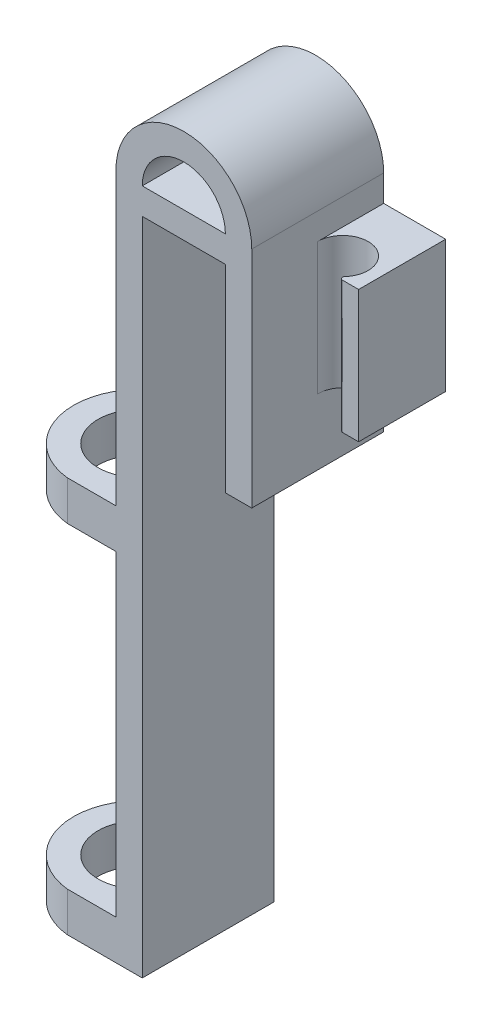
ISO-10303-21;
HEADER;
FILE_DESCRIPTION(('STEP AP214'),'2;1');
FILE_NAME('part.step','',(''),(''),'','','');
FILE_SCHEMA(('AUTOMOTIVE_DESIGN { 1 0 10303 214 1 1 1 1 }'));
ENDSEC;
DATA;
#1=APPLICATION_CONTEXT('core data for automotive mechanical design processes');
#2=APPLICATION_PROTOCOL_DEFINITION('international standard','automotive_design',2000,#1);
#3=PRODUCT_CONTEXT('',#1,'mechanical');
#4=PRODUCT('Part','Part','',(#3));
#5=PRODUCT_RELATED_PRODUCT_CATEGORY('part','',(#4));
#6=PRODUCT_DEFINITION_FORMATION('','',#4);
#7=PRODUCT_DEFINITION_CONTEXT('part definition',#1,'design');
#8=PRODUCT_DEFINITION('design','',#6,#7);
#9=PRODUCT_DEFINITION_SHAPE('','',#8);
#10=(LENGTH_UNIT() NAMED_UNIT(*) SI_UNIT(.MILLI.,.METRE.));
#11=(NAMED_UNIT(*) PLANE_ANGLE_UNIT() SI_UNIT($,.RADIAN.));
#12=(NAMED_UNIT(*) SI_UNIT($,.STERADIAN.) SOLID_ANGLE_UNIT());
#13=UNCERTAINTY_MEASURE_WITH_UNIT(LENGTH_MEASURE(1.E-05),#10,'distance_accuracy_value','');
#14=(GEOMETRIC_REPRESENTATION_CONTEXT(3) GLOBAL_UNCERTAINTY_ASSIGNED_CONTEXT((#13)) GLOBAL_UNIT_ASSIGNED_CONTEXT((#10,
#11,#12)) REPRESENTATION_CONTEXT('',''));
#15=CARTESIAN_POINT('',(0.,0.,0.));
#16=DIRECTION('',(0.,0.,1.));
#17=DIRECTION('',(1.,0.,0.));
#18=AXIS2_PLACEMENT_3D('',#15,#16,#17);
#19=CARTESIAN_POINT('',(0.,-50.,10.));
#20=DIRECTION('',(0.,-1.,0.));
#21=DIRECTION('',(0.,0.,-1.));
#22=AXIS2_PLACEMENT_3D('',#19,#20,#21);
#23=PLANE('',#22);
#24=CARTESIAN_POINT('',(-5.17499999999998,-50.,5.));
#25=DIRECTION('',(0.,-1.,0.));
#26=DIRECTION('',(0.,0.,-1.));
#27=AXIS2_PLACEMENT_3D('',#24,#25,#26);
#28=CIRCLE('',#27,3.175);
#29=CARTESIAN_POINT('',(-5.17499999999998,-50.,1.825));
#30=VERTEX_POINT('',#29);
#31=EDGE_CURVE('E316',#30,#30,#28,.F.);
#32=ORIENTED_EDGE('',*,*,#31,.T.);
#33=EDGE_LOOP('',(#32));
#34=FACE_BOUND('',#33,.T.);
#35=DIRECTION('',(-1.,0.,0.));
#36=VECTOR('',#35,1.);
#37=CARTESIAN_POINT('',(0.,-50.,10.));
#38=LINE('',#37,#36);
#39=CARTESIAN_POINT('',(0.,-50.,10.));
#40=VERTEX_POINT('',#39);
#41=CARTESIAN_POINT('',(-5.67562460986252,-50.,10.));
#42=VERTEX_POINT('',#41);
#43=EDGE_CURVE('E431',#40,#42,#38,.T.);
#44=ORIENTED_EDGE('',*,*,#43,.T.);
#45=CARTESIAN_POINT('',(-5.17499999999998,-50.,5.));
#46=DIRECTION('',(0.,-1.,0.));
#47=DIRECTION('',(0.,0.,-1.));
#48=AXIS2_PLACEMENT_3D('',#45,#46,#47);
#49=CIRCLE('',#48,5.025);
#50=CARTESIAN_POINT('',(-5.6756246098625,-50.,0.));
#51=VERTEX_POINT('',#50);
#52=EDGE_CURVE('E295',#51,#42,#49,.F.);
#53=ORIENTED_EDGE('',*,*,#52,.F.);
#54=DIRECTION('',(-1.,0.,0.));
#55=VECTOR('',#54,1.);
#56=CARTESIAN_POINT('',(0.,-50.,0.));
#57=LINE('',#56,#55);
#58=CARTESIAN_POINT('',(0.,-50.,0.));
#59=VERTEX_POINT('',#58);
#60=EDGE_CURVE('E362',#59,#51,#57,.T.);
#61=ORIENTED_EDGE('',*,*,#60,.F.);
#62=DIRECTION('',(0.,0.,-1.));
#63=VECTOR('',#62,1.);
#64=CARTESIAN_POINT('',(0.,-50.,10.));
#65=LINE('',#64,#63);
#66=EDGE_CURVE('E390',#40,#59,#65,.T.);
#67=ORIENTED_EDGE('',*,*,#66,.F.);
#68=EDGE_LOOP('',(#44,#53,#61,#67));
#69=FACE_BOUND('',#68,.T.);
#70=ADVANCED_FACE('F71',(#34,#69),#23,.T.);
#71=CARTESIAN_POINT('',(-1.99999999999999,-47.,-8.73155198117723));
#72=DIRECTION('',(0.,1.,0.));
#73=DIRECTION('',(0.,0.,1.));
#74=AXIS2_PLACEMENT_3D('',#71,#72,#73);
#75=PLANE('',#74);
#76=CARTESIAN_POINT('',(-5.17499999999998,-47.,5.));
#77=DIRECTION('',(0.,1.,0.));
#78=DIRECTION('',(0.,0.,1.));
#79=AXIS2_PLACEMENT_3D('',#76,#77,#78);
#80=CIRCLE('',#79,5.025);
#81=CARTESIAN_POINT('',(-5.67562460986251,-47.,0.));
#82=VERTEX_POINT('',#81);
#83=CARTESIAN_POINT('',(-5.67562460986253,-47.,10.));
#84=VERTEX_POINT('',#83);
#85=EDGE_CURVE('E310',#82,#84,#80,.T.);
#86=ORIENTED_EDGE('',*,*,#85,.T.);
#87=DIRECTION('',(-1.,0.,0.));
#88=VECTOR('',#87,1.);
#89=CARTESIAN_POINT('',(-1.99999999999999,-47.,10.));
#90=LINE('',#89,#88);
#91=CARTESIAN_POINT('',(-2.,-47.,10.));
#92=VERTEX_POINT('',#91);
#93=EDGE_CURVE('E350',#92,#84,#90,.T.);
#94=ORIENTED_EDGE('',*,*,#93,.F.);
#95=DIRECTION('',(0.,0.,1.));
#96=VECTOR('',#95,1.);
#97=CARTESIAN_POINT('',(-1.99999999999999,-47.,-8.73155198117723));
#98=LINE('',#97,#96);
#99=CARTESIAN_POINT('',(-1.99999999999999,-47.,5.));
#100=VERTEX_POINT('',#99);
#101=EDGE_CURVE('E354',#100,#92,#98,.T.);
#102=ORIENTED_EDGE('',*,*,#101,.F.);
#103=CARTESIAN_POINT('',(-5.17499999999998,-47.,5.));
#104=DIRECTION('',(0.,1.,0.));
#105=DIRECTION('',(0.,0.,1.));
#106=AXIS2_PLACEMENT_3D('',#103,#104,#105);
#107=CIRCLE('',#106,3.175);
#108=EDGE_CURVE('E323',#100,#100,#107,.T.);
#109=ORIENTED_EDGE('',*,*,#108,.F.);
#110=CARTESIAN_POINT('',(-1.99999999999999,-47.,0.));
#111=VERTEX_POINT('',#110);
#112=EDGE_CURVE('E355',#111,#100,#98,.T.);
#113=ORIENTED_EDGE('',*,*,#112,.F.);
#114=DIRECTION('',(1.,0.,0.));
#115=VECTOR('',#114,1.);
#116=CARTESIAN_POINT('',(-1.99999999999999,-47.,0.));
#117=LINE('',#116,#115);
#118=EDGE_CURVE('E359',#82,#111,#117,.T.);
#119=ORIENTED_EDGE('',*,*,#118,.F.);
#120=EDGE_LOOP('',(#86,#94,#102,#109,#113,#119));
#121=FACE_BOUND('',#120,.T.);
#122=ADVANCED_FACE('F513',(#121),#75,.T.);
#123=CARTESIAN_POINT('',(-1.99999999999999,-23.,-8.73155198117723));
#124=DIRECTION('',(0.,-1.,0.));
#125=DIRECTION('',(0.,0.,-1.));
#126=AXIS2_PLACEMENT_3D('',#123,#124,#125);
#127=PLANE('',#126);
#128=DIRECTION('',(1.,0.,0.));
#129=VECTOR('',#128,1.);
#130=CARTESIAN_POINT('',(-1.99999999999999,-23.,10.));
#131=LINE('',#130,#129);
#132=CARTESIAN_POINT('',(-5.67562460986254,-23.,10.));
#133=VERTEX_POINT('',#132);
#134=CARTESIAN_POINT('',(-1.99999999999999,-23.,10.));
#135=VERTEX_POINT('',#134);
#136=EDGE_CURVE('E336',#133,#135,#131,.T.);
#137=ORIENTED_EDGE('',*,*,#136,.F.);
#138=CARTESIAN_POINT('',(-5.17499999999999,-23.,5.));
#139=DIRECTION('',(0.,-1.,0.));
#140=DIRECTION('',(0.,0.,-1.));
#141=AXIS2_PLACEMENT_3D('',#138,#139,#140);
#142=CIRCLE('',#141,5.025);
#143=CARTESIAN_POINT('',(-5.67562460986252,-23.,0.));
#144=VERTEX_POINT('',#143);
#145=EDGE_CURVE('E299',#133,#144,#142,.T.);
#146=ORIENTED_EDGE('',*,*,#145,.T.);
#147=DIRECTION('',(-1.,0.,0.));
#148=VECTOR('',#147,1.);
#149=CARTESIAN_POINT('',(-1.99999999999999,-23.,0.));
#150=LINE('',#149,#148);
#151=CARTESIAN_POINT('',(-1.99999999999999,-23.,0.));
#152=VERTEX_POINT('',#151);
#153=EDGE_CURVE('E327',#152,#144,#150,.T.);
#154=ORIENTED_EDGE('',*,*,#153,.F.);
#155=DIRECTION('',(0.,0.,1.));
#156=VECTOR('',#155,1.);
#157=CARTESIAN_POINT('',(-1.99999999999999,-23.,-8.73155198117723));
#158=LINE('',#157,#156);
#159=CARTESIAN_POINT('',(-1.99999999999999,-23.,5.));
#160=VERTEX_POINT('',#159);
#161=EDGE_CURVE('E332',#152,#160,#158,.T.);
#162=ORIENTED_EDGE('',*,*,#161,.T.);
#163=CARTESIAN_POINT('',(-5.17499999999999,-23.,5.));
#164=DIRECTION('',(0.,-1.,0.));
#165=DIRECTION('',(0.,0.,-1.));
#166=AXIS2_PLACEMENT_3D('',#163,#164,#165);
#167=CIRCLE('',#166,3.175);
#168=EDGE_CURVE('E320',#160,#160,#167,.T.);
#169=ORIENTED_EDGE('',*,*,#168,.F.);
#170=EDGE_CURVE('E343',#160,#135,#158,.T.);
#171=ORIENTED_EDGE('',*,*,#170,.T.);
#172=EDGE_LOOP('',(#137,#146,#154,#162,#169,#171));
#173=FACE_BOUND('',#172,.T.);
#174=ADVANCED_FACE('F518',(#173),#127,.T.);
#175=CARTESIAN_POINT('',(-1.99999999999999,-20.,-8.73155198117723));
#176=DIRECTION('',(0.,1.,0.));
#177=DIRECTION('',(-1.,0.,0.));
#178=AXIS2_PLACEMENT_3D('',#175,#176,#177);
#179=PLANE('',#178);
#180=CARTESIAN_POINT('',(-5.17499999999999,-20.,5.));
#181=DIRECTION('',(0.,1.,0.));
#182=DIRECTION('',(-1.,0.,0.));
#183=AXIS2_PLACEMENT_3D('',#180,#181,#182);
#184=CIRCLE('',#183,5.025);
#185=CARTESIAN_POINT('',(-5.67562460986252,-20.,0.));
#186=VERTEX_POINT('',#185);
#187=CARTESIAN_POINT('',(-5.67562460986254,-20.,10.));
#188=VERTEX_POINT('',#187);
#189=EDGE_CURVE('E296',#186,#188,#184,.T.);
#190=ORIENTED_EDGE('',*,*,#189,.T.);
#191=DIRECTION('',(-1.,0.,0.));
#192=VECTOR('',#191,1.);
#193=CARTESIAN_POINT('',(-1.99999999999999,-20.,10.));
#194=LINE('',#193,#192);
#195=CARTESIAN_POINT('',(-1.99999999999999,-20.,10.));
#196=VERTEX_POINT('',#195);
#197=EDGE_CURVE('E326',#196,#188,#194,.T.);
#198=ORIENTED_EDGE('',*,*,#197,.F.);
#199=DIRECTION('',(0.,0.,1.));
#200=VECTOR('',#199,1.);
#201=CARTESIAN_POINT('',(-1.99999999999999,-20.,-8.73155198117723));
#202=LINE('',#201,#200);
#203=CARTESIAN_POINT('',(-1.99999999999999,-20.,5.));
#204=VERTEX_POINT('',#203);
#205=EDGE_CURVE('E339',#204,#196,#202,.T.);
#206=ORIENTED_EDGE('',*,*,#205,.F.);
#207=CARTESIAN_POINT('',(-5.17499999999999,-20.,5.));
#208=DIRECTION('',(0.,1.,0.));
#209=DIRECTION('',(-1.,0.,0.));
#210=AXIS2_PLACEMENT_3D('',#207,#208,#209);
#211=CIRCLE('',#210,3.175);
#212=EDGE_CURVE('E313',#204,#204,#211,.T.);
#213=ORIENTED_EDGE('',*,*,#212,.F.);
#214=CARTESIAN_POINT('',(-2.,-20.,0.));
#215=VERTEX_POINT('',#214);
#216=EDGE_CURVE('E344',#215,#204,#202,.T.);
#217=ORIENTED_EDGE('',*,*,#216,.F.);
#218=DIRECTION('',(1.,0.,0.));
#219=VECTOR('',#218,1.);
#220=CARTESIAN_POINT('',(-1.99999999999999,-20.,0.));
#221=LINE('',#220,#219);
#222=EDGE_CURVE('E331',#186,#215,#221,.T.);
#223=ORIENTED_EDGE('',*,*,#222,.F.);
#224=EDGE_LOOP('',(#190,#198,#206,#213,#217,#223));
#225=FACE_BOUND('',#224,.T.);
#226=ADVANCED_FACE('F556',(#225),#179,.T.);
#227=CARTESIAN_POINT('',(0.,0.,10.));
#228=DIRECTION('',(0.,0.,1.));
#229=DIRECTION('',(1.,0.,0.));
#230=AXIS2_PLACEMENT_3D('',#227,#228,#229);
#231=PLANE('',#230);
#232=DIRECTION('',(0.,1.,0.));
#233=VECTOR('',#232,1.);
#234=CARTESIAN_POINT('',(8.3,0.,10.));
#235=LINE('',#234,#233);
#236=CARTESIAN_POINT('',(8.3,-15.,10.));
#237=VERTEX_POINT('',#236);
#238=CARTESIAN_POINT('',(8.3,2.,10.));
#239=VERTEX_POINT('',#238);
#240=EDGE_CURVE('E373',#237,#239,#235,.T.);
#241=ORIENTED_EDGE('',*,*,#240,.T.);
#242=CARTESIAN_POINT('',(3.15,2.,10.));
#243=DIRECTION('',(0.,0.,1.));
#244=DIRECTION('',(1.,0.,0.));
#245=AXIS2_PLACEMENT_3D('',#242,#243,#244);
#246=CIRCLE('',#245,5.15);
#247=CARTESIAN_POINT('',(-2.,2.,10.));
#248=VERTEX_POINT('',#247);
#249=EDGE_CURVE('E266',#239,#248,#246,.T.);
#250=ORIENTED_EDGE('',*,*,#249,.T.);
#251=DIRECTION('',(0.,1.,0.));
#252=VECTOR('',#251,1.);
#253=CARTESIAN_POINT('',(-2.,0.,10.));
#254=LINE('',#253,#252);
#255=EDGE_CURVE('E380',#196,#248,#254,.T.);
#256=ORIENTED_EDGE('',*,*,#255,.F.);
#257=ORIENTED_EDGE('',*,*,#197,.T.);
#258=DIRECTION('',(0.,1.,0.));
#259=VECTOR('',#258,1.);
#260=CARTESIAN_POINT('',(-5.67562460986252,-56.7431426405558,10.));
#261=LINE('',#260,#259);
#262=EDGE_CURVE('E277',#133,#188,#261,.T.);
#263=ORIENTED_EDGE('',*,*,#262,.F.);
#264=ORIENTED_EDGE('',*,*,#136,.T.);
#265=EDGE_CURVE('E381',#92,#135,#254,.T.);
#266=ORIENTED_EDGE('',*,*,#265,.F.);
#267=ORIENTED_EDGE('',*,*,#93,.T.);
#268=EDGE_CURVE('E291',#42,#84,#261,.T.);
#269=ORIENTED_EDGE('',*,*,#268,.F.);
#270=ORIENTED_EDGE('',*,*,#43,.F.);
#271=DIRECTION('',(0.,-1.,0.));
#272=VECTOR('',#271,1.);
#273=CARTESIAN_POINT('',(0.,0.,10.));
#274=LINE('',#273,#272);
#275=CARTESIAN_POINT('',(0.,0.,10.));
#276=VERTEX_POINT('',#275);
#277=EDGE_CURVE('E435',#276,#40,#274,.T.);
#278=ORIENTED_EDGE('',*,*,#277,.F.);
#279=DIRECTION('',(1.,0.,0.));
#280=VECTOR('',#279,1.);
#281=CARTESIAN_POINT('',(0.,0.,10.));
#282=LINE('',#281,#280);
#283=CARTESIAN_POINT('',(6.3,0.,10.));
#284=VERTEX_POINT('',#283);
#285=EDGE_CURVE('E363',#276,#284,#282,.T.);
#286=ORIENTED_EDGE('',*,*,#285,.T.);
#287=DIRECTION('',(0.,-1.,0.));
#288=VECTOR('',#287,1.);
#289=CARTESIAN_POINT('',(6.3,0.,10.));
#290=LINE('',#289,#288);
#291=CARTESIAN_POINT('',(6.3,-15.,10.));
#292=VERTEX_POINT('',#291);
#293=EDGE_CURVE('E366',#284,#292,#290,.T.);
#294=ORIENTED_EDGE('',*,*,#293,.T.);
#295=DIRECTION('',(1.,0.,0.));
#296=VECTOR('',#295,1.);
#297=CARTESIAN_POINT('',(0.,-15.,10.));
#298=LINE('',#297,#296);
#299=EDGE_CURVE('E370',#292,#237,#298,.T.);
#300=ORIENTED_EDGE('',*,*,#299,.T.);
#301=EDGE_LOOP('',(#241,#250,#256,#257,#263,#264,#266,#267,#269,#270,#278,#286,#294,#300));
#302=FACE_BOUND('',#301,.T.);
#303=DIRECTION('',(1.,0.,0.));
#304=VECTOR('',#303,1.);
#305=CARTESIAN_POINT('',(0.,2.,10.));
#306=LINE('',#305,#304);
#307=CARTESIAN_POINT('',(0.,2.,10.));
#308=VERTEX_POINT('',#307);
#309=CARTESIAN_POINT('',(6.3,2.,10.));
#310=VERTEX_POINT('',#309);
#311=EDGE_CURVE('E376',#308,#310,#306,.T.);
#312=ORIENTED_EDGE('',*,*,#311,.F.);
#313=CARTESIAN_POINT('',(3.15,2.,10.));
#314=DIRECTION('',(0.,0.,-1.));
#315=DIRECTION('',(1.,0.,0.));
#316=AXIS2_PLACEMENT_3D('',#313,#314,#315);
#317=CIRCLE('',#316,3.15);
#318=EDGE_CURVE('E281',#308,#310,#317,.T.);
#319=ORIENTED_EDGE('',*,*,#318,.T.);
#320=EDGE_LOOP('',(#312,#319));
#321=FACE_BOUND('',#320,.T.);
#322=ADVANCED_FACE('F553',(#302,#321),#231,.T.);
#323=CARTESIAN_POINT('',(0.,0.,0.));
#324=DIRECTION('',(0.,0.,1.));
#325=DIRECTION('',(1.,0.,0.));
#326=AXIS2_PLACEMENT_3D('',#323,#324,#325);
#327=PLANE('',#326);
#328=CARTESIAN_POINT('',(3.15,2.,0.));
#329=DIRECTION('',(0.,0.,1.));
#330=DIRECTION('',(1.,0.,0.));
#331=AXIS2_PLACEMENT_3D('',#328,#329,#330);
#332=CIRCLE('',#331,3.15);
#333=CARTESIAN_POINT('',(6.3,2.,0.));
#334=VERTEX_POINT('',#333);
#335=CARTESIAN_POINT('',(0.,2.,0.));
#336=VERTEX_POINT('',#335);
#337=EDGE_CURVE('E268',#334,#336,#332,.T.);
#338=ORIENTED_EDGE('',*,*,#337,.T.);
#339=DIRECTION('',(1.,0.,0.));
#340=VECTOR('',#339,1.);
#341=CARTESIAN_POINT('',(0.,2.,0.));
#342=LINE('',#341,#340);
#343=EDGE_CURVE('E400',#336,#334,#342,.T.);
#344=ORIENTED_EDGE('',*,*,#343,.T.);
#345=EDGE_LOOP('',(#338,#344));
#346=FACE_BOUND('',#345,.T.);
#347=DIRECTION('',(0.,1.,0.));
#348=VECTOR('',#347,1.);
#349=CARTESIAN_POINT('',(-5.6756246098625,-56.7431426405558,0.));
#350=LINE('',#349,#348);
#351=EDGE_CURVE('E303',#144,#186,#350,.T.);
#352=ORIENTED_EDGE('',*,*,#351,.T.);
#353=ORIENTED_EDGE('',*,*,#222,.T.);
#354=DIRECTION('',(0.,1.,0.));
#355=VECTOR('',#354,1.);
#356=CARTESIAN_POINT('',(-2.,0.,0.));
#357=LINE('',#356,#355);
#358=CARTESIAN_POINT('',(-2.,2.,0.));
#359=VERTEX_POINT('',#358);
#360=EDGE_CURVE('E404',#215,#359,#357,.T.);
#361=ORIENTED_EDGE('',*,*,#360,.T.);
#362=CARTESIAN_POINT('',(3.15,2.,0.));
#363=DIRECTION('',(0.,0.,1.));
#364=DIRECTION('',(1.,0.,0.));
#365=AXIS2_PLACEMENT_3D('',#362,#363,#364);
#366=CIRCLE('',#365,5.15);
#367=CARTESIAN_POINT('',(8.3,2.,0.));
#368=VERTEX_POINT('',#367);
#369=EDGE_CURVE('E272',#359,#368,#366,.F.);
#370=ORIENTED_EDGE('',*,*,#369,.T.);
#371=DIRECTION('',(0.,1.,0.));
#372=VECTOR('',#371,1.);
#373=CARTESIAN_POINT('',(8.3,0.,0.));
#374=LINE('',#373,#372);
#375=CARTESIAN_POINT('',(8.3,0.,0.));
#376=VERTEX_POINT('',#375);
#377=EDGE_CURVE('E396',#376,#368,#374,.T.);
#378=ORIENTED_EDGE('',*,*,#377,.F.);
#379=DIRECTION('',(1.,0.,0.));
#380=VECTOR('',#379,1.);
#381=CARTESIAN_POINT('',(8.3,0.,0.));
#382=LINE('',#381,#380);
#383=CARTESIAN_POINT('',(13.,0.,0.));
#384=VERTEX_POINT('',#383);
#385=EDGE_CURVE('E267',#376,#384,#382,.T.);
#386=ORIENTED_EDGE('',*,*,#385,.T.);
#387=DIRECTION('',(0.,-1.,0.));
#388=VECTOR('',#387,1.);
#389=CARTESIAN_POINT('',(13.,0.,0.));
#390=LINE('',#389,#388);
#391=CARTESIAN_POINT('',(13.,-10.,0.));
#392=VERTEX_POINT('',#391);
#393=EDGE_CURVE('E468',#384,#392,#390,.T.);
#394=ORIENTED_EDGE('',*,*,#393,.T.);
#395=DIRECTION('',(-1.,0.,0.));
#396=VECTOR('',#395,1.);
#397=CARTESIAN_POINT('',(8.3,-10.,0.));
#398=LINE('',#397,#396);
#399=CARTESIAN_POINT('',(8.3,-10.,0.));
#400=VERTEX_POINT('',#399);
#401=EDGE_CURVE('E251',#392,#400,#398,.T.);
#402=ORIENTED_EDGE('',*,*,#401,.T.);
#403=CARTESIAN_POINT('',(8.3,-15.,0.));
#404=VERTEX_POINT('',#403);
#405=EDGE_CURVE('E397',#404,#400,#374,.T.);
#406=ORIENTED_EDGE('',*,*,#405,.F.);
#407=DIRECTION('',(1.,0.,0.));
#408=VECTOR('',#407,1.);
#409=CARTESIAN_POINT('',(0.,-15.,0.));
#410=LINE('',#409,#408);
#411=CARTESIAN_POINT('',(6.3,-15.,0.));
#412=VERTEX_POINT('',#411);
#413=EDGE_CURVE('E393',#412,#404,#410,.T.);
#414=ORIENTED_EDGE('',*,*,#413,.F.);
#415=DIRECTION('',(0.,-1.,0.));
#416=VECTOR('',#415,1.);
#417=CARTESIAN_POINT('',(6.3,0.,0.));
#418=LINE('',#417,#416);
#419=CARTESIAN_POINT('',(6.3,0.,0.));
#420=VERTEX_POINT('',#419);
#421=EDGE_CURVE('E389',#420,#412,#418,.T.);
#422=ORIENTED_EDGE('',*,*,#421,.F.);
#423=DIRECTION('',(1.,0.,0.));
#424=VECTOR('',#423,1.);
#425=CARTESIAN_POINT('',(0.,0.,0.));
#426=LINE('',#425,#424);
#427=CARTESIAN_POINT('',(0.,0.,0.));
#428=VERTEX_POINT('',#427);
#429=EDGE_CURVE('E386',#428,#420,#426,.T.);
#430=ORIENTED_EDGE('',*,*,#429,.F.);
#431=DIRECTION('',(0.,-1.,0.));
#432=VECTOR('',#431,1.);
#433=CARTESIAN_POINT('',(0.,0.,0.));
#434=LINE('',#433,#432);
#435=EDGE_CURVE('E436',#428,#59,#434,.T.);
#436=ORIENTED_EDGE('',*,*,#435,.T.);
#437=ORIENTED_EDGE('',*,*,#60,.T.);
#438=EDGE_CURVE('E300',#51,#82,#350,.T.);
#439=ORIENTED_EDGE('',*,*,#438,.T.);
#440=ORIENTED_EDGE('',*,*,#118,.T.);
#441=EDGE_CURVE('E367',#111,#152,#357,.T.);
#442=ORIENTED_EDGE('',*,*,#441,.T.);
#443=ORIENTED_EDGE('',*,*,#153,.T.);
#444=EDGE_LOOP('',(#352,#353,#361,#370,#378,#386,#394,#402,#406,#414,#422,#430,#436,#437,#439,
#440,#442,#443));
#445=FACE_BOUND('',#444,.T.);
#446=ADVANCED_FACE('F498',(#346,#445),#327,.F.);
#447=CARTESIAN_POINT('',(-2.,0.,10.));
#448=DIRECTION('',(-1.,0.,0.));
#449=DIRECTION('',(0.,0.,1.));
#450=AXIS2_PLACEMENT_3D('',#447,#448,#449);
#451=PLANE('',#450);
#452=ORIENTED_EDGE('',*,*,#170,.F.);
#453=ORIENTED_EDGE('',*,*,#161,.F.);
#454=ORIENTED_EDGE('',*,*,#441,.F.);
#455=ORIENTED_EDGE('',*,*,#112,.T.);
#456=ORIENTED_EDGE('',*,*,#101,.T.);
#457=ORIENTED_EDGE('',*,*,#265,.T.);
#458=EDGE_LOOP('',(#452,#453,#454,#455,#456,#457));
#459=FACE_BOUND('',#458,.T.);
#460=ADVANCED_FACE('F549',(#459),#451,.T.);
#461=ORIENTED_EDGE('',*,*,#216,.T.);
#462=ORIENTED_EDGE('',*,*,#205,.T.);
#463=ORIENTED_EDGE('',*,*,#255,.T.);
#464=DIRECTION('',(0.,0.,-1.));
#465=VECTOR('',#464,1.);
#466=CARTESIAN_POINT('',(-2.,2.,10.));
#467=LINE('',#466,#465);
#468=EDGE_CURVE('E385',#248,#359,#467,.T.);
#469=ORIENTED_EDGE('',*,*,#468,.T.);
#470=ORIENTED_EDGE('',*,*,#360,.F.);
#471=EDGE_LOOP('',(#461,#462,#463,#469,#470));
#472=FACE_BOUND('',#471,.T.);
#473=ADVANCED_FACE('F530',(#472),#451,.T.);
#474=CARTESIAN_POINT('',(0.,0.,10.));
#475=DIRECTION('',(0.,1.,0.));
#476=DIRECTION('',(0.,0.,1.));
#477=AXIS2_PLACEMENT_3D('',#474,#475,#476);
#478=PLANE('',#477);
#479=ORIENTED_EDGE('',*,*,#285,.F.);
#480=DIRECTION('',(0.,0.,-1.));
#481=VECTOR('',#480,1.);
#482=CARTESIAN_POINT('',(0.,0.,10.));
#483=LINE('',#482,#481);
#484=EDGE_CURVE('E427',#276,#428,#483,.T.);
#485=ORIENTED_EDGE('',*,*,#484,.T.);
#486=ORIENTED_EDGE('',*,*,#429,.T.);
#487=DIRECTION('',(0.,0.,-1.));
#488=VECTOR('',#487,1.);
#489=CARTESIAN_POINT('',(6.3,0.,10.));
#490=LINE('',#489,#488);
#491=EDGE_CURVE('E423',#284,#420,#490,.T.);
#492=ORIENTED_EDGE('',*,*,#491,.F.);
#493=EDGE_LOOP('',(#479,#485,#486,#492));
#494=FACE_BOUND('',#493,.T.);
#495=ADVANCED_FACE('F529',(#494),#478,.F.);
#496=CARTESIAN_POINT('',(6.3,0.,10.));
#497=DIRECTION('',(1.,0.,0.));
#498=DIRECTION('',(0.,1.,0.));
#499=AXIS2_PLACEMENT_3D('',#496,#497,#498);
#500=PLANE('',#499);
#501=ORIENTED_EDGE('',*,*,#421,.T.);
#502=DIRECTION('',(0.,0.,-1.));
#503=VECTOR('',#502,1.);
#504=CARTESIAN_POINT('',(6.3,-15.,10.));
#505=LINE('',#504,#503);
#506=EDGE_CURVE('E419',#292,#412,#505,.T.);
#507=ORIENTED_EDGE('',*,*,#506,.F.);
#508=ORIENTED_EDGE('',*,*,#293,.F.);
#509=ORIENTED_EDGE('',*,*,#491,.T.);
#510=EDGE_LOOP('',(#501,#507,#508,#509));
#511=FACE_BOUND('',#510,.T.);
#512=ADVANCED_FACE('F533',(#511),#500,.F.);
#513=CARTESIAN_POINT('',(0.,-15.,10.));
#514=DIRECTION('',(0.,1.,0.));
#515=DIRECTION('',(-1.,0.,0.));
#516=AXIS2_PLACEMENT_3D('',#513,#514,#515);
#517=PLANE('',#516);
#518=ORIENTED_EDGE('',*,*,#413,.T.);
#519=DIRECTION('',(0.,0.,-1.));
#520=VECTOR('',#519,1.);
#521=CARTESIAN_POINT('',(8.3,-15.,10.));
#522=LINE('',#521,#520);
#523=EDGE_CURVE('E415',#237,#404,#522,.T.);
#524=ORIENTED_EDGE('',*,*,#523,.F.);
#525=ORIENTED_EDGE('',*,*,#299,.F.);
#526=ORIENTED_EDGE('',*,*,#506,.T.);
#527=EDGE_LOOP('',(#518,#524,#525,#526));
#528=FACE_BOUND('',#527,.T.);
#529=ADVANCED_FACE('F537',(#528),#517,.F.);
#530=CARTESIAN_POINT('',(8.3,0.,10.));
#531=DIRECTION('',(-1.,0.,0.));
#532=DIRECTION('',(0.,0.,1.));
#533=AXIS2_PLACEMENT_3D('',#530,#531,#532);
#534=PLANE('',#533);
#535=ORIENTED_EDGE('',*,*,#405,.T.);
#536=DIRECTION('',(0.,0.,1.));
#537=VECTOR('',#536,1.);
#538=CARTESIAN_POINT('',(8.3,-10.,-11.0494343746637));
#539=LINE('',#538,#537);
#540=CARTESIAN_POINT('',(8.3,-10.,5.));
#541=VERTEX_POINT('',#540);
#542=EDGE_CURVE('E253',#400,#541,#539,.T.);
#543=ORIENTED_EDGE('',*,*,#542,.T.);
#544=DIRECTION('',(0.,1.,0.));
#545=VECTOR('',#544,1.);
#546=CARTESIAN_POINT('',(8.3,-16.8622153857191,5.));
#547=LINE('',#546,#545);
#548=CARTESIAN_POINT('',(8.3,0.,5.));
#549=VERTEX_POINT('',#548);
#550=EDGE_CURVE('E234',#541,#549,#547,.T.);
#551=ORIENTED_EDGE('',*,*,#550,.T.);
#552=DIRECTION('',(0.,0.,1.));
#553=VECTOR('',#552,1.);
#554=CARTESIAN_POINT('',(8.3,0.,-11.0494343746637));
#555=LINE('',#554,#553);
#556=EDGE_CURVE('E257',#376,#549,#555,.T.);
#557=ORIENTED_EDGE('',*,*,#556,.F.);
#558=ORIENTED_EDGE('',*,*,#377,.T.);
#559=DIRECTION('',(0.,0.,-1.));
#560=VECTOR('',#559,1.);
#561=CARTESIAN_POINT('',(8.3,2.,10.));
#562=LINE('',#561,#560);
#563=EDGE_CURVE('E411',#239,#368,#562,.T.);
#564=ORIENTED_EDGE('',*,*,#563,.F.);
#565=ORIENTED_EDGE('',*,*,#240,.F.);
#566=ORIENTED_EDGE('',*,*,#523,.T.);
#567=EDGE_LOOP('',(#535,#543,#551,#557,#558,#564,#565,#566));
#568=FACE_BOUND('',#567,.T.);
#569=ADVANCED_FACE('F492',(#568),#534,.F.);
#570=CARTESIAN_POINT('',(0.,2.,10.));
#571=DIRECTION('',(0.,1.,0.));
#572=DIRECTION('',(0.,0.,1.));
#573=AXIS2_PLACEMENT_3D('',#570,#571,#572);
#574=PLANE('',#573);
#575=DIRECTION('',(0.,0.,1.));
#576=VECTOR('',#575,1.);
#577=CARTESIAN_POINT('',(0.,2.,-11.5157500841239));
#578=LINE('',#577,#576);
#579=EDGE_CURVE('E285',#336,#308,#578,.T.);
#580=ORIENTED_EDGE('',*,*,#579,.T.);
#581=ORIENTED_EDGE('',*,*,#311,.T.);
#582=DIRECTION('',(0.,0.,1.));
#583=VECTOR('',#582,1.);
#584=CARTESIAN_POINT('',(6.3,2.,-11.5157500841239));
#585=LINE('',#584,#583);
#586=EDGE_CURVE('E273',#334,#310,#585,.T.);
#587=ORIENTED_EDGE('',*,*,#586,.F.);
#588=ORIENTED_EDGE('',*,*,#343,.F.);
#589=EDGE_LOOP('',(#580,#581,#587,#588));
#590=FACE_BOUND('',#589,.T.);
#591=ADVANCED_FACE('F527',(#590),#574,.T.);
#592=CARTESIAN_POINT('',(0.,0.,10.));
#593=DIRECTION('',(1.,0.,0.));
#594=DIRECTION('',(0.,1.,0.));
#595=AXIS2_PLACEMENT_3D('',#592,#593,#594);
#596=PLANE('',#595);
#597=ORIENTED_EDGE('',*,*,#435,.F.);
#598=ORIENTED_EDGE('',*,*,#484,.F.);
#599=ORIENTED_EDGE('',*,*,#277,.T.);
#600=ORIENTED_EDGE('',*,*,#66,.T.);
#601=EDGE_LOOP('',(#597,#598,#599,#600));
#602=FACE_BOUND('',#601,.T.);
#603=ADVANCED_FACE('F523',(#602),#596,.T.);
#604=CARTESIAN_POINT('',(-5.17499999999997,-58.9802561210692,5.));
#605=DIRECTION('',(0.,1.,0.));
#606=DIRECTION('',(-1.,0.,0.));
#607=AXIS2_PLACEMENT_3D('',#604,#605,#606);
#608=CYLINDRICAL_SURFACE('',#607,3.175);
#609=ORIENTED_EDGE('',*,*,#168,.T.);
#610=EDGE_LOOP('',(#609));
#611=FACE_BOUND('',#610,.T.);
#612=ORIENTED_EDGE('',*,*,#212,.T.);
#613=EDGE_LOOP('',(#612));
#614=FACE_BOUND('',#613,.T.);
#615=ADVANCED_FACE('F526',(#611,#614),#608,.F.);
#616=ORIENTED_EDGE('',*,*,#108,.T.);
#617=EDGE_LOOP('',(#616));
#618=FACE_BOUND('',#617,.T.);
#619=ORIENTED_EDGE('',*,*,#31,.F.);
#620=EDGE_LOOP('',(#619));
#621=FACE_BOUND('',#620,.T.);
#622=ADVANCED_FACE('F567',(#618,#621),#608,.F.);
#623=CARTESIAN_POINT('',(-5.17499999999998,-56.7431426405558,5.));
#624=DIRECTION('',(0.,1.,0.));
#625=DIRECTION('',(-1.,0.,0.));
#626=AXIS2_PLACEMENT_3D('',#623,#624,#625);
#627=CYLINDRICAL_SURFACE('',#626,5.025);
#628=ORIENTED_EDGE('',*,*,#145,.F.);
#629=ORIENTED_EDGE('',*,*,#262,.T.);
#630=ORIENTED_EDGE('',*,*,#189,.F.);
#631=ORIENTED_EDGE('',*,*,#351,.F.);
#632=EDGE_LOOP('',(#628,#629,#630,#631));
#633=FACE_BOUND('',#632,.T.);
#634=ADVANCED_FACE('F569',(#633),#627,.T.);
#635=ORIENTED_EDGE('',*,*,#438,.F.);
#636=ORIENTED_EDGE('',*,*,#52,.T.);
#637=ORIENTED_EDGE('',*,*,#268,.T.);
#638=ORIENTED_EDGE('',*,*,#85,.F.);
#639=EDGE_LOOP('',(#635,#636,#637,#638));
#640=FACE_BOUND('',#639,.T.);
#641=ADVANCED_FACE('F572',(#640),#627,.T.);
#642=CARTESIAN_POINT('',(3.15,2.,-11.5157500841239));
#643=DIRECTION('',(0.,0.,1.));
#644=DIRECTION('',(1.,0.,0.));
#645=AXIS2_PLACEMENT_3D('',#642,#643,#644);
#646=CYLINDRICAL_SURFACE('',#645,5.15);
#647=ORIENTED_EDGE('',*,*,#369,.F.);
#648=ORIENTED_EDGE('',*,*,#468,.F.);
#649=ORIENTED_EDGE('',*,*,#249,.F.);
#650=ORIENTED_EDGE('',*,*,#563,.T.);
#651=EDGE_LOOP('',(#647,#648,#649,#650));
#652=FACE_BOUND('',#651,.T.);
#653=ADVANCED_FACE('F508',(#652),#646,.T.);
#654=CARTESIAN_POINT('',(3.15,2.,-11.5157500841239));
#655=DIRECTION('',(0.,0.,1.));
#656=DIRECTION('',(1.,0.,0.));
#657=AXIS2_PLACEMENT_3D('',#654,#655,#656);
#658=CYLINDRICAL_SURFACE('',#657,3.15);
#659=ORIENTED_EDGE('',*,*,#337,.F.);
#660=ORIENTED_EDGE('',*,*,#586,.T.);
#661=ORIENTED_EDGE('',*,*,#318,.F.);
#662=ORIENTED_EDGE('',*,*,#579,.F.);
#663=EDGE_LOOP('',(#659,#660,#661,#662));
#664=FACE_BOUND('',#663,.T.);
#665=ADVANCED_FACE('F501',(#664),#658,.F.);
#666=CARTESIAN_POINT('',(8.3,0.,-11.0494343746637));
#667=DIRECTION('',(0.,1.,0.));
#668=DIRECTION('',(0.,0.,1.));
#669=AXIS2_PLACEMENT_3D('',#666,#667,#668);
#670=PLANE('',#669);
#671=CARTESIAN_POINT('',(10.21,0.,5.));
#672=DIRECTION('',(0.,1.,0.));
#673=DIRECTION('',(0.,0.,1.));
#674=AXIS2_PLACEMENT_3D('',#671,#672,#673);
#675=CIRCLE('',#674,1.91);
#676=CARTESIAN_POINT('',(11.639004658388,0.,6.26729857819905));
#677=VERTEX_POINT('',#676);
#678=EDGE_CURVE('E478',#677,#549,#675,.T.);
#679=ORIENTED_EDGE('',*,*,#678,.F.);
#680=CARTESIAN_POINT('',(11.7886386540307,0.,6.4));
#681=DIRECTION('',(0.,1.,0.));
#682=DIRECTION('',(0.,0.,1.));
#683=AXIS2_PLACEMENT_3D('',#680,#681,#682);
#684=CIRCLE('',#683,0.2);
#685=CARTESIAN_POINT('',(11.7886386540307,0.,6.6));
#686=VERTEX_POINT('',#685);
#687=EDGE_CURVE('E94',#677,#686,#684,.T.);
#688=ORIENTED_EDGE('',*,*,#687,.T.);
#689=DIRECTION('',(-1.,0.,0.));
#690=VECTOR('',#689,1.);
#691=CARTESIAN_POINT('',(13.,0.,6.6));
#692=LINE('',#691,#690);
#693=CARTESIAN_POINT('',(13.,0.,6.6));
#694=VERTEX_POINT('',#693);
#695=EDGE_CURVE('E246',#694,#686,#692,.T.);
#696=ORIENTED_EDGE('',*,*,#695,.F.);
#697=DIRECTION('',(0.,0.,1.));
#698=VECTOR('',#697,1.);
#699=CARTESIAN_POINT('',(13.,0.,-11.0494343746637));
#700=LINE('',#699,#698);
#701=EDGE_CURVE('E244',#384,#694,#700,.T.);
#702=ORIENTED_EDGE('',*,*,#701,.F.);
#703=ORIENTED_EDGE('',*,*,#385,.F.);
#704=ORIENTED_EDGE('',*,*,#556,.T.);
#705=EDGE_LOOP('',(#679,#688,#696,#702,#703,#704));
#706=FACE_BOUND('',#705,.T.);
#707=ADVANCED_FACE('F499',(#706),#670,.T.);
#708=CARTESIAN_POINT('',(13.,0.,-11.0494343746637));
#709=DIRECTION('',(1.,0.,0.));
#710=DIRECTION('',(0.,1.,0.));
#711=AXIS2_PLACEMENT_3D('',#708,#709,#710);
#712=PLANE('',#711);
#713=DIRECTION('',(0.,1.,0.));
#714=VECTOR('',#713,1.);
#715=CARTESIAN_POINT('',(13.,-16.8622153857191,6.6));
#716=LINE('',#715,#714);
#717=CARTESIAN_POINT('',(13.,-10.,6.6));
#718=VERTEX_POINT('',#717);
#719=EDGE_CURVE('E229',#718,#694,#716,.T.);
#720=ORIENTED_EDGE('',*,*,#719,.F.);
#721=DIRECTION('',(0.,0.,1.));
#722=VECTOR('',#721,1.);
#723=CARTESIAN_POINT('',(13.,-10.,-11.0494343746637));
#724=LINE('',#723,#722);
#725=EDGE_CURVE('E241',#392,#718,#724,.T.);
#726=ORIENTED_EDGE('',*,*,#725,.F.);
#727=ORIENTED_EDGE('',*,*,#393,.F.);
#728=ORIENTED_EDGE('',*,*,#701,.T.);
#729=EDGE_LOOP('',(#720,#726,#727,#728));
#730=FACE_BOUND('',#729,.T.);
#731=ADVANCED_FACE('F239',(#730),#712,.T.);
#732=CARTESIAN_POINT('',(8.3,-10.,-11.0494343746637));
#733=DIRECTION('',(0.,-1.,0.));
#734=DIRECTION('',(0.,0.,-1.));
#735=AXIS2_PLACEMENT_3D('',#732,#733,#734);
#736=PLANE('',#735);
#737=DIRECTION('',(-1.,0.,0.));
#738=VECTOR('',#737,1.);
#739=CARTESIAN_POINT('',(13.,-10.,6.6));
#740=LINE('',#739,#738);
#741=CARTESIAN_POINT('',(11.7886386540307,-10.,6.6));
#742=VERTEX_POINT('',#741);
#743=EDGE_CURVE('E226',#718,#742,#740,.T.);
#744=ORIENTED_EDGE('',*,*,#743,.T.);
#745=CARTESIAN_POINT('',(11.7886386540307,-10.,6.4));
#746=DIRECTION('',(0.,-1.,0.));
#747=DIRECTION('',(0.,0.,-1.));
#748=AXIS2_PLACEMENT_3D('',#745,#746,#747);
#749=CIRCLE('',#748,0.2);
#750=CARTESIAN_POINT('',(11.639004658388,-10.,6.26729857819905));
#751=VERTEX_POINT('',#750);
#752=EDGE_CURVE('E12',#742,#751,#749,.T.);
#753=ORIENTED_EDGE('',*,*,#752,.T.);
#754=CARTESIAN_POINT('',(10.21,-10.,5.));
#755=DIRECTION('',(0.,-1.,0.));
#756=DIRECTION('',(0.,0.,-1.));
#757=AXIS2_PLACEMENT_3D('',#754,#755,#756);
#758=CIRCLE('',#757,1.91);
#759=EDGE_CURVE('E260',#751,#541,#758,.F.);
#760=ORIENTED_EDGE('',*,*,#759,.T.);
#761=ORIENTED_EDGE('',*,*,#542,.F.);
#762=ORIENTED_EDGE('',*,*,#401,.F.);
#763=ORIENTED_EDGE('',*,*,#725,.T.);
#764=EDGE_LOOP('',(#744,#753,#760,#761,#762,#763));
#765=FACE_BOUND('',#764,.T.);
#766=ADVANCED_FACE('F248',(#765),#736,.T.);
#767=CARTESIAN_POINT('',(10.21,-15.4022958082652,5.));
#768=DIRECTION('',(0.,1.,0.));
#769=DIRECTION('',(0.,0.,1.));
#770=AXIS2_PLACEMENT_3D('',#767,#768,#769);
#771=CYLINDRICAL_SURFACE('',#770,1.91);
#772=ORIENTED_EDGE('',*,*,#759,.F.);
#773=DIRECTION('',(0.,1.,0.));
#774=VECTOR('',#773,1.);
#775=CARTESIAN_POINT('',(11.639004658388,-15.4022958082652,6.26729857819905));
#776=LINE('',#775,#774);
#777=EDGE_CURVE('E430',#751,#677,#776,.T.);
#778=ORIENTED_EDGE('',*,*,#777,.T.);
#779=ORIENTED_EDGE('',*,*,#678,.T.);
#780=ORIENTED_EDGE('',*,*,#550,.F.);
#781=EDGE_LOOP('',(#772,#778,#779,#780));
#782=FACE_BOUND('',#781,.T.);
#783=ADVANCED_FACE('F490',(#782),#771,.F.);
#784=CARTESIAN_POINT('',(13.,-16.8622153857191,6.6));
#785=DIRECTION('',(0.,0.,-1.));
#786=DIRECTION('',(-1.,0.,0.));
#787=AXIS2_PLACEMENT_3D('',#784,#785,#786);
#788=PLANE('',#787);
#789=ORIENTED_EDGE('',*,*,#695,.T.);
#790=DIRECTION('',(0.,1.,0.));
#791=VECTOR('',#790,1.);
#792=CARTESIAN_POINT('',(11.7886386540307,-16.8622153857191,6.6));
#793=LINE('',#792,#791);
#794=EDGE_CURVE('E80',#686,#742,#793,.F.);
#795=ORIENTED_EDGE('',*,*,#794,.T.);
#796=ORIENTED_EDGE('',*,*,#743,.F.);
#797=ORIENTED_EDGE('',*,*,#719,.T.);
#798=EDGE_LOOP('',(#789,#795,#796,#797));
#799=FACE_BOUND('',#798,.T.);
#800=ADVANCED_FACE('F228',(#799),#788,.F.);
#801=CARTESIAN_POINT('',(11.7886386540307,-15.4022958082652,6.4));
#802=DIRECTION('',(0.,1.,0.));
#803=DIRECTION('',(0.,0.,1.));
#804=AXIS2_PLACEMENT_3D('',#801,#802,#803);
#805=CYLINDRICAL_SURFACE('',#804,0.2);
#806=ORIENTED_EDGE('',*,*,#752,.F.);
#807=ORIENTED_EDGE('',*,*,#794,.F.);
#808=ORIENTED_EDGE('',*,*,#687,.F.);
#809=ORIENTED_EDGE('',*,*,#777,.F.);
#810=EDGE_LOOP('',(#806,#807,#808,#809));
#811=FACE_BOUND('',#810,.T.);
#812=ADVANCED_FACE('F73',(#811),#805,.T.);
#813=CLOSED_SHELL('',(#70,#122,#174,#226,#322,#446,#460,#473,#495,#512,#529,#569,#591,#603,#615,
#622,#634,#641,#653,#665,#707,#731,#766,#783,#800,#812));
#814=MANIFOLD_SOLID_BREP('B2',#813);
#815=ADVANCED_BREP_SHAPE_REPRESENTATION('',(#18,#814),#14);
#816=SHAPE_DEFINITION_REPRESENTATION(#9,#815);
ENDSEC;
END-ISO-10303-21;
